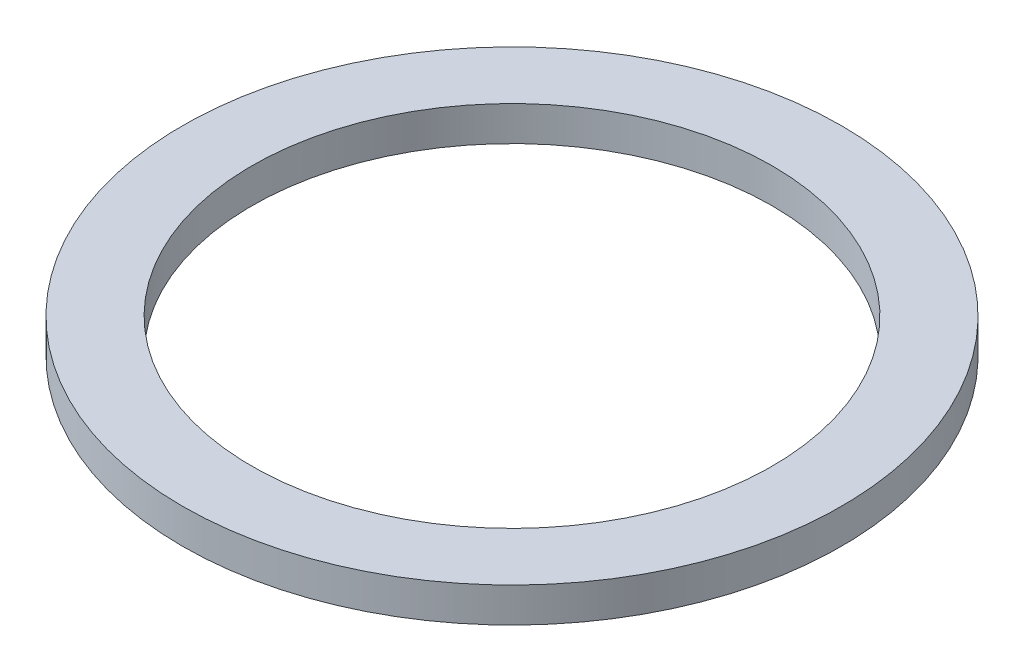
ISO-10303-21;
HEADER;
FILE_DESCRIPTION(('STEP AP214'),'2;1');
FILE_NAME('part.step','',(''),(''),'','','');
FILE_SCHEMA(('AUTOMOTIVE_DESIGN { 1 0 10303 214 1 1 1 1 }'));
ENDSEC;
DATA;
#1=APPLICATION_CONTEXT('core data for automotive mechanical design processes');
#2=APPLICATION_PROTOCOL_DEFINITION('international standard','automotive_design',2000,#1);
#3=PRODUCT_CONTEXT('',#1,'mechanical');
#4=PRODUCT('Part','Part','',(#3));
#5=PRODUCT_RELATED_PRODUCT_CATEGORY('part','',(#4));
#6=PRODUCT_DEFINITION_FORMATION('','',#4);
#7=PRODUCT_DEFINITION_CONTEXT('part definition',#1,'design');
#8=PRODUCT_DEFINITION('design','',#6,#7);
#9=PRODUCT_DEFINITION_SHAPE('','',#8);
#10=(LENGTH_UNIT() NAMED_UNIT(*) SI_UNIT(.MILLI.,.METRE.));
#11=(NAMED_UNIT(*) PLANE_ANGLE_UNIT() SI_UNIT($,.RADIAN.));
#12=(NAMED_UNIT(*) SI_UNIT($,.STERADIAN.) SOLID_ANGLE_UNIT());
#13=UNCERTAINTY_MEASURE_WITH_UNIT(LENGTH_MEASURE(1.E-05),#10,'distance_accuracy_value','');
#14=(GEOMETRIC_REPRESENTATION_CONTEXT(3) GLOBAL_UNCERTAINTY_ASSIGNED_CONTEXT((#13)) GLOBAL_UNIT_ASSIGNED_CONTEXT((#10,
#11,#12)) REPRESENTATION_CONTEXT('',''));
#15=CARTESIAN_POINT('',(0.,0.,0.));
#16=DIRECTION('',(0.,0.,1.));
#17=DIRECTION('',(1.,0.,0.));
#18=AXIS2_PLACEMENT_3D('',#15,#16,#17);
#19=CARTESIAN_POINT('',(0.,2.,0.));
#20=DIRECTION('',(0.,1.,0.));
#21=DIRECTION('',(0.,0.,1.));
#22=AXIS2_PLACEMENT_3D('',#19,#20,#21);
#23=PLANE('',#22);
#24=CARTESIAN_POINT('',(0.,2.,0.));
#25=DIRECTION('',(0.,-1.,0.));
#26=DIRECTION('',(0.,0.,-1.));
#27=AXIS2_PLACEMENT_3D('',#24,#25,#26);
#28=CIRCLE('',#27,19.);
#29=CARTESIAN_POINT('',(0.,2.,-19.));
#30=VERTEX_POINT('',#29);
#31=EDGE_CURVE('E26',#30,#30,#28,.T.);
#32=ORIENTED_EDGE('',*,*,#31,.F.);
#33=EDGE_LOOP('',(#32));
#34=FACE_BOUND('',#33,.T.);
#35=CARTESIAN_POINT('',(0.,2.,0.));
#36=DIRECTION('',(0.,-1.,0.));
#37=DIRECTION('',(0.,0.,-1.));
#38=AXIS2_PLACEMENT_3D('',#35,#36,#37);
#39=CIRCLE('',#38,15.);
#40=CARTESIAN_POINT('',(0.,2.,-15.));
#41=VERTEX_POINT('',#40);
#42=EDGE_CURVE('E17',#41,#41,#39,.T.);
#43=ORIENTED_EDGE('',*,*,#42,.T.);
#44=EDGE_LOOP('',(#43));
#45=FACE_BOUND('',#44,.T.);
#46=ADVANCED_FACE('F14',(#34,#45),#23,.T.);
#47=CARTESIAN_POINT('',(0.,2.,0.));
#48=DIRECTION('',(0.,-1.,0.));
#49=DIRECTION('',(0.,0.,-1.));
#50=AXIS2_PLACEMENT_3D('',#47,#48,#49);
#51=CYLINDRICAL_SURFACE('',#50,15.);
#52=CARTESIAN_POINT('',(0.,0.,0.));
#53=DIRECTION('',(0.,-1.,0.));
#54=DIRECTION('',(0.,0.,-1.));
#55=AXIS2_PLACEMENT_3D('',#52,#53,#54);
#56=CIRCLE('',#55,15.);
#57=CARTESIAN_POINT('',(0.,0.,-15.));
#58=VERTEX_POINT('',#57);
#59=EDGE_CURVE('E21',#58,#58,#56,.T.);
#60=ORIENTED_EDGE('',*,*,#59,.T.);
#61=EDGE_LOOP('',(#60));
#62=FACE_BOUND('',#61,.T.);
#63=ORIENTED_EDGE('',*,*,#42,.F.);
#64=EDGE_LOOP('',(#63));
#65=FACE_BOUND('',#64,.T.);
#66=ADVANCED_FACE('F35',(#62,#65),#51,.F.);
#67=CARTESIAN_POINT('',(0.,2.,0.));
#68=DIRECTION('',(0.,-1.,0.));
#69=DIRECTION('',(0.,0.,-1.));
#70=AXIS2_PLACEMENT_3D('',#67,#68,#69);
#71=CYLINDRICAL_SURFACE('',#70,19.);
#72=ORIENTED_EDGE('',*,*,#31,.T.);
#73=EDGE_LOOP('',(#72));
#74=FACE_BOUND('',#73,.T.);
#75=CARTESIAN_POINT('',(0.,0.,0.));
#76=DIRECTION('',(0.,-1.,0.));
#77=DIRECTION('',(0.,0.,-1.));
#78=AXIS2_PLACEMENT_3D('',#75,#76,#77);
#79=CIRCLE('',#78,19.);
#80=CARTESIAN_POINT('',(0.,0.,-19.));
#81=VERTEX_POINT('',#80);
#82=EDGE_CURVE('E10',#81,#81,#79,.F.);
#83=ORIENTED_EDGE('',*,*,#82,.T.);
#84=EDGE_LOOP('',(#83));
#85=FACE_BOUND('',#84,.T.);
#86=ADVANCED_FACE('F37',(#74,#85),#71,.T.);
#87=CARTESIAN_POINT('',(0.,0.,0.));
#88=DIRECTION('',(0.,1.,0.));
#89=DIRECTION('',(0.,0.,1.));
#90=AXIS2_PLACEMENT_3D('',#87,#88,#89);
#91=PLANE('',#90);
#92=ORIENTED_EDGE('',*,*,#82,.F.);
#93=EDGE_LOOP('',(#92));
#94=FACE_BOUND('',#93,.T.);
#95=ORIENTED_EDGE('',*,*,#59,.F.);
#96=EDGE_LOOP('',(#95));
#97=FACE_BOUND('',#96,.T.);
#98=ADVANCED_FACE('F44',(#94,#97),#91,.F.);
#99=CLOSED_SHELL('',(#46,#66,#86,#98));
#100=MANIFOLD_SOLID_BREP('B1',#99);
#101=ADVANCED_BREP_SHAPE_REPRESENTATION('',(#18,#100),#14);
#102=SHAPE_DEFINITION_REPRESENTATION(#9,#101);
ENDSEC;
END-ISO-10303-21;
